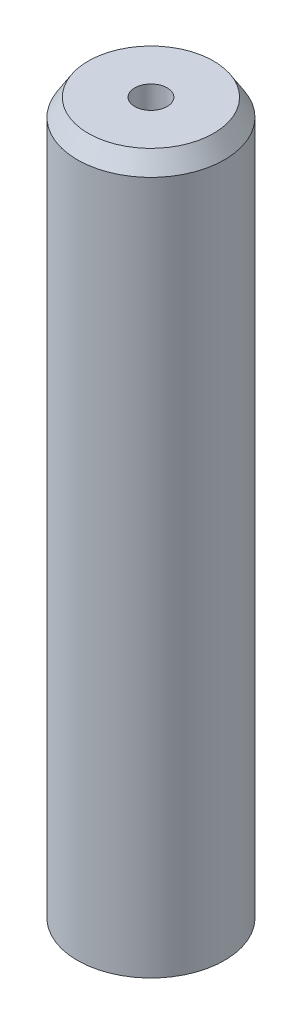
ISO-10303-21;
HEADER;
FILE_DESCRIPTION(('STEP AP214'),'2;1');
FILE_NAME('part.step','',(''),(''),'','','');
FILE_SCHEMA(('AUTOMOTIVE_DESIGN { 1 0 10303 214 1 1 1 1 }'));
ENDSEC;
DATA;
#1=APPLICATION_CONTEXT('core data for automotive mechanical design processes');
#2=APPLICATION_PROTOCOL_DEFINITION('international standard','automotive_design',2000,#1);
#3=PRODUCT_CONTEXT('',#1,'mechanical');
#4=PRODUCT('Part','Part','',(#3));
#5=PRODUCT_RELATED_PRODUCT_CATEGORY('part','',(#4));
#6=PRODUCT_DEFINITION_FORMATION('','',#4);
#7=PRODUCT_DEFINITION_CONTEXT('part definition',#1,'design');
#8=PRODUCT_DEFINITION('design','',#6,#7);
#9=PRODUCT_DEFINITION_SHAPE('','',#8);
#10=(LENGTH_UNIT() NAMED_UNIT(*) SI_UNIT(.MILLI.,.METRE.));
#11=(NAMED_UNIT(*) PLANE_ANGLE_UNIT() SI_UNIT($,.RADIAN.));
#12=(NAMED_UNIT(*) SI_UNIT($,.STERADIAN.) SOLID_ANGLE_UNIT());
#13=UNCERTAINTY_MEASURE_WITH_UNIT(LENGTH_MEASURE(1.E-05),#10,'distance_accuracy_value','');
#14=(GEOMETRIC_REPRESENTATION_CONTEXT(3) GLOBAL_UNCERTAINTY_ASSIGNED_CONTEXT((#13)) GLOBAL_UNIT_ASSIGNED_CONTEXT((#10,
#11,#12)) REPRESENTATION_CONTEXT('',''));
#15=CARTESIAN_POINT('',(0.,0.,0.));
#16=DIRECTION('',(0.,0.,1.));
#17=DIRECTION('',(1.,0.,0.));
#18=AXIS2_PLACEMENT_3D('',#15,#16,#17);
#19=CARTESIAN_POINT('',(0.,49.0384613744747,0.));
#20=DIRECTION('',(0.,-1.,0.));
#21=DIRECTION('',(0.,0.,-1.));
#22=AXIS2_PLACEMENT_3D('',#19,#20,#21);
#23=CYLINDRICAL_SURFACE('',#22,5.);
#24=CARTESIAN_POINT('',(0.,47.8531399955309,0.));
#25=DIRECTION('',(0.,1.,0.));
#26=DIRECTION('',(0.,0.,1.));
#27=AXIS2_PLACEMENT_3D('',#24,#25,#26);
#28=CIRCLE('',#27,5.);
#29=CARTESIAN_POINT('',(0.,47.8531399955309,5.));
#30=VERTEX_POINT('',#29);
#31=EDGE_CURVE('E50',#30,#30,#28,.F.);
#32=ORIENTED_EDGE('',*,*,#31,.T.);
#33=EDGE_LOOP('',(#32));
#34=FACE_BOUND('',#33,.T.);
#35=CARTESIAN_POINT('',(0.,0.739883507574549,0.));
#36=DIRECTION('',(0.,1.,0.));
#37=DIRECTION('',(0.,0.,1.));
#38=AXIS2_PLACEMENT_3D('',#35,#36,#37);
#39=CIRCLE('',#38,5.);
#40=CARTESIAN_POINT('',(0.,0.739883507574548,5.));
#41=VERTEX_POINT('',#40);
#42=EDGE_CURVE('E51',#41,#41,#39,.T.);
#43=ORIENTED_EDGE('',*,*,#42,.T.);
#44=EDGE_LOOP('',(#43));
#45=FACE_BOUND('',#44,.T.);
#46=ADVANCED_FACE('F39',(#34,#45),#23,.T.);
#47=CARTESIAN_POINT('',(0.,49.0384613744747,0.));
#48=DIRECTION('',(0.,1.,0.));
#49=DIRECTION('',(0.,0.,1.));
#50=AXIS2_PLACEMENT_3D('',#47,#48,#49);
#51=PLANE('',#50);
#52=CARTESIAN_POINT('',(0.,49.0384613744747,0.));
#53=DIRECTION('',(0.,1.,0.));
#54=DIRECTION('',(0.,0.,1.));
#55=AXIS2_PLACEMENT_3D('',#52,#53,#54);
#56=CIRCLE('',#55,4.26011649242546);
#57=CARTESIAN_POINT('',(0.,49.0384613744747,4.26011649242546));
#58=VERTEX_POINT('',#57);
#59=EDGE_CURVE('E54',#58,#58,#56,.T.);
#60=ORIENTED_EDGE('',*,*,#59,.T.);
#61=EDGE_LOOP('',(#60));
#62=FACE_BOUND('',#61,.T.);
#63=CARTESIAN_POINT('',(0.,49.0384613744747,0.));
#64=DIRECTION('',(0.,1.,0.));
#65=DIRECTION('',(0.,0.,1.));
#66=AXIS2_PLACEMENT_3D('',#63,#64,#65);
#67=CIRCLE('',#66,1.10136190557761);
#68=CARTESIAN_POINT('',(0.,49.0384613744747,1.10136190557761));
#69=VERTEX_POINT('',#68);
#70=EDGE_CURVE('E58',#69,#69,#67,.T.);
#71=ORIENTED_EDGE('',*,*,#70,.F.);
#72=EDGE_LOOP('',(#71));
#73=FACE_BOUND('',#72,.T.);
#74=ADVANCED_FACE('F69',(#62,#73),#51,.T.);
#75=CARTESIAN_POINT('',(0.,0.,0.));
#76=DIRECTION('',(0.,1.,0.));
#77=DIRECTION('',(0.,0.,1.));
#78=AXIS2_PLACEMENT_3D('',#75,#76,#77);
#79=PLANE('',#78);
#80=CARTESIAN_POINT('',(0.,0.,0.));
#81=DIRECTION('',(0.,1.,0.));
#82=DIRECTION('',(0.,0.,1.));
#83=AXIS2_PLACEMENT_3D('',#80,#81,#82);
#84=CIRCLE('',#83,3.81467862105617);
#85=CARTESIAN_POINT('',(0.,0.,3.81467862105617));
#86=VERTEX_POINT('',#85);
#87=EDGE_CURVE('E10',#86,#86,#84,.F.);
#88=ORIENTED_EDGE('',*,*,#87,.T.);
#89=EDGE_LOOP('',(#88));
#90=FACE_BOUND('',#89,.T.);
#91=CARTESIAN_POINT('',(0.,0.,0.));
#92=DIRECTION('',(0.,1.,0.));
#93=DIRECTION('',(0.,0.,1.));
#94=AXIS2_PLACEMENT_3D('',#91,#92,#93);
#95=CIRCLE('',#94,1.10136190557761);
#96=CARTESIAN_POINT('',(0.,0.,1.10136190557761));
#97=VERTEX_POINT('',#96);
#98=EDGE_CURVE('E63',#97,#97,#95,.T.);
#99=ORIENTED_EDGE('',*,*,#98,.T.);
#100=EDGE_LOOP('',(#99));
#101=FACE_BOUND('',#100,.T.);
#102=ADVANCED_FACE('F75',(#90,#101),#79,.F.);
#103=CARTESIAN_POINT('',(0.,49.0384613744747,0.));
#104=DIRECTION('',(0.,-1.,0.));
#105=DIRECTION('',(0.,0.,-1.));
#106=AXIS2_PLACEMENT_3D('',#103,#104,#105);
#107=CYLINDRICAL_SURFACE('',#106,1.10136190557761);
#108=ORIENTED_EDGE('',*,*,#70,.T.);
#109=EDGE_LOOP('',(#108));
#110=FACE_BOUND('',#109,.T.);
#111=ORIENTED_EDGE('',*,*,#98,.F.);
#112=EDGE_LOOP('',(#111));
#113=FACE_BOUND('',#112,.T.);
#114=ADVANCED_FACE('F70',(#110,#113),#107,.F.);
#115=CARTESIAN_POINT('',(0.,49.0384613744747,0.));
#116=DIRECTION('',(0.,-1.,0.));
#117=DIRECTION('',(0.,0.,-1.));
#118=AXIS2_PLACEMENT_3D('',#115,#116,#117);
#119=CONICAL_SURFACE('',#118,4.26011649242546,0.558027411244179);
#120=ORIENTED_EDGE('',*,*,#31,.F.);
#121=EDGE_LOOP('',(#120));
#122=FACE_BOUND('',#121,.T.);
#123=ORIENTED_EDGE('',*,*,#59,.F.);
#124=EDGE_LOOP('',(#123));
#125=FACE_BOUND('',#124,.T.);
#126=ADVANCED_FACE('F81',(#122,#125),#119,.T.);
#127=CARTESIAN_POINT('',(0.,0.739883507574549,0.));
#128=DIRECTION('',(0.,1.,0.));
#129=DIRECTION('',(0.,0.,1.));
#130=AXIS2_PLACEMENT_3D('',#127,#128,#129);
#131=CONICAL_SURFACE('',#130,5.,1.01276891555071);
#132=CARTESIAN_POINT('',(0.,0.,3.81467862105617));
#133=CARTESIAN_POINT('',(0.,0.00770711987056823,3.8270257187535));
#134=CARTESIAN_POINT('',(0.,0.0154142397411364,3.83937281645084));
#135=CARTESIAN_POINT('',(0.,0.0308284794822727,3.8640670118455));
#136=CARTESIAN_POINT('',(0.,0.0385355993528409,3.87641410954283));
#137=CARTESIAN_POINT('',(0.,0.0539498390939773,3.90110830493749));
#138=CARTESIAN_POINT('',(0.,0.0616569589645456,3.91345540263483));
#139=CARTESIAN_POINT('',(0.,0.0770711987056821,3.93814959802949));
#140=CARTESIAN_POINT('',(0.,0.0847783185762503,3.95049669572682));
#141=CARTESIAN_POINT('',(0.,0.100192558317387,3.97519089112148));
#142=CARTESIAN_POINT('',(0.,0.107899678187955,3.98753798881882));
#143=CARTESIAN_POINT('',(0.,0.123313917929091,4.01223218421348));
#144=CARTESIAN_POINT('',(0.,0.13102103779966,4.02457928191081));
#145=CARTESIAN_POINT('',(0.,0.146435277540796,4.04927347730547));
#146=CARTESIAN_POINT('',(0.,0.154142397411364,4.0616205750028));
#147=CARTESIAN_POINT('',(0.,0.169556637152501,4.08631477039747));
#148=CARTESIAN_POINT('',(0.,0.177263757023069,4.0986618680948));
#149=CARTESIAN_POINT('',(0.,0.192677996764205,4.12335606348946));
#150=CARTESIAN_POINT('',(0.,0.200385116634774,4.13570316118679));
#151=CARTESIAN_POINT('',(0.,0.21579935637591,4.16039735658146));
#152=CARTESIAN_POINT('',(0.,0.223506476246478,4.17274445427879));
#153=CARTESIAN_POINT('',(0.,0.238920715987614,4.19743864967345));
#154=CARTESIAN_POINT('',(0.,0.246627835858183,4.20978574737078));
#155=CARTESIAN_POINT('',(0.,0.262042075599319,4.23447994276544));
#156=CARTESIAN_POINT('',(0.,0.269749195469887,4.24682704046278));
#157=CARTESIAN_POINT('',(0.,0.285163435211024,4.27152123585744));
#158=CARTESIAN_POINT('',(0.,0.292870555081592,4.28386833355477));
#159=CARTESIAN_POINT('',(0.,0.308284794822729,4.30856252894943));
#160=CARTESIAN_POINT('',(0.,0.315991914693297,4.32090962664677));
#161=CARTESIAN_POINT('',(0.,0.331406154434433,4.34560382204143));
#162=CARTESIAN_POINT('',(0.,0.339113274305001,4.35795091973876));
#163=CARTESIAN_POINT('',(0.,0.354527514046138,4.38264511513342));
#164=CARTESIAN_POINT('',(0.,0.362234633916706,4.39499221283076));
#165=CARTESIAN_POINT('',(0.,0.377648873657842,4.41968640822542));
#166=CARTESIAN_POINT('',(0.,0.385355993528411,4.43203350592275));
#167=CARTESIAN_POINT('',(0.,0.400770233269547,4.45672770131741));
#168=CARTESIAN_POINT('',(0.,0.408477353140115,4.46907479901474));
#169=CARTESIAN_POINT('',(0.,0.423891592881252,4.49376899440941));
#170=CARTESIAN_POINT('',(0.,0.43159871275182,4.50611609210674));
#171=CARTESIAN_POINT('',(0.,0.447012952492956,4.5308102875014));
#172=CARTESIAN_POINT('',(0.,0.454720072363524,4.54315738519873));
#173=CARTESIAN_POINT('',(0.,0.470134312104661,4.5678515805934));
#174=CARTESIAN_POINT('',(0.,0.477841431975229,4.58019867829073));
#175=CARTESIAN_POINT('',(0.,0.493255671716366,4.60489287368539));
#176=CARTESIAN_POINT('',(0.,0.500962791586934,4.61723997138272));
#177=CARTESIAN_POINT('',(0.,0.51637703132807,4.64193416677739));
#178=CARTESIAN_POINT('',(0.,0.524084151198638,4.65428126447472));
#179=CARTESIAN_POINT('',(0.,0.539498390939775,4.67897545986938));
#180=CARTESIAN_POINT('',(0.,0.547205510810343,4.69132255756671));
#181=CARTESIAN_POINT('',(0.,0.56261975055148,4.71601675296137));
#182=CARTESIAN_POINT('',(0.,0.570326870422048,4.72836385065871));
#183=CARTESIAN_POINT('',(0.,0.585741110163184,4.75305804605337));
#184=CARTESIAN_POINT('',(0.,0.593448230033752,4.7654051437507));
#185=CARTESIAN_POINT('',(0.,0.608862469774889,4.79009933914536));
#186=CARTESIAN_POINT('',(0.,0.616569589645457,4.8024464368427));
#187=CARTESIAN_POINT('',(0.,0.631983829386593,4.82714063223736));
#188=CARTESIAN_POINT('',(0.,0.639690949257162,4.83948772993469));
#189=CARTESIAN_POINT('',(0.,0.655105188998298,4.86418192532935));
#190=CARTESIAN_POINT('',(0.,0.662812308868866,4.87652902302669));
#191=CARTESIAN_POINT('',(0.,0.678226548610003,4.90122321842135));
#192=CARTESIAN_POINT('',(0.,0.685933668480571,4.91357031611868));
#193=CARTESIAN_POINT('',(0.,0.701347908221707,4.93826451151334));
#194=CARTESIAN_POINT('',(0.,0.709055028092276,4.95061160921067));
#195=CARTESIAN_POINT('',(0.,0.724469267833412,4.97530580460534));
#196=CARTESIAN_POINT('',(0.,0.73217638770398,4.98765290230267));
#197=CARTESIAN_POINT('',(0.,0.739883507574548,5.));
#198=B_SPLINE_CURVE_WITH_KNOTS('',3,(#132,#133,#134,#135,#136,#137,#138,#139,#140,#141,#142,
#143,#144,#145,#146,#147,#148,#149,#150,#151,#152,#153,#154,#155,#156,#157,#158,#159,#160,#161,
#162,#163,#164,#165,#166,#167,#168,#169,#170,#171,#172,#173,#174,#175,#176,#177,#178,#179,#180,
#181,#182,#183,#184,#185,#186,#187,#188,#189,#190,#191,#192,#193,#194,#195,#196,#197),
.UNSPECIFIED.,.F.,.F.,(4,2,2,2,2,2,2,2,2,2,2,2,2,2,2,2,2,2,2,2,2,2,2,2,2,2,2,2,2,2,2,2,4),(0.,
0.043665256946694,0.0873305138933883,0.130995770840082,0.174661027786776,0.218326284733471,
0.261991541680164,0.305656798626859,0.349322055573552,0.392987312520246,0.436652569466941,
0.480317826413634,0.523983083360329,0.567648340307022,0.611313597253717,0.654978854200411,
0.698644111147105,0.742309368093799,0.785974625040493,0.829639881987187,0.873305138933881,
0.916970395880575,0.960635652827269,1.00430090977396,1.04796616672066,1.09163142366735,
1.13529668061404,1.17896193756074,1.22262719450743,1.26629245145413,1.30995770840082,
1.35362296534752,1.39728822229421),.UNSPECIFIED.);
#199=EDGE_CURVE('BSEAM45',#86,#41,#198,.T.);
#200=ORIENTED_EDGE('',*,*,#87,.F.);
#201=ORIENTED_EDGE('',*,*,#42,.F.);
#202=ORIENTED_EDGE('',*,*,#199,.T.);
#203=ORIENTED_EDGE('',*,*,#199,.F.);
#204=EDGE_LOOP('',(#200,#202,#201,#203));
#205=FACE_BOUND('',#204,.T.);
#206=ADVANCED_FACE('F45',(#205),#131,.T.);
#207=CLOSED_SHELL('',(#46,#74,#102,#114,#126,#206));
#208=MANIFOLD_SOLID_BREP('B2',#207);
#209=ADVANCED_BREP_SHAPE_REPRESENTATION('',(#18,#208),#14);
#210=SHAPE_DEFINITION_REPRESENTATION(#9,#209);
ENDSEC;
END-ISO-10303-21;
